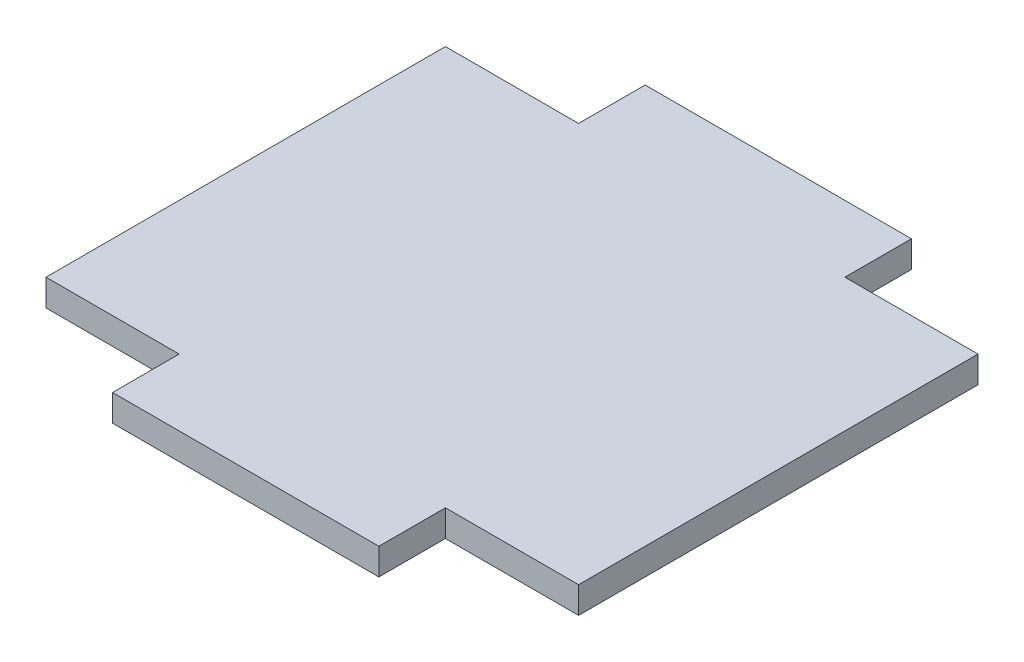
ISO-10303-21;
HEADER;
FILE_DESCRIPTION(('STEP AP214'),'2;1');
FILE_NAME('part.step','',(''),(''),'','','');
FILE_SCHEMA(('AUTOMOTIVE_DESIGN { 1 0 10303 214 1 1 1 1 }'));
ENDSEC;
DATA;
#1=APPLICATION_CONTEXT('core data for automotive mechanical design processes');
#2=APPLICATION_PROTOCOL_DEFINITION('international standard','automotive_design',2000,#1);
#3=PRODUCT_CONTEXT('',#1,'mechanical');
#4=PRODUCT('Part','Part','',(#3));
#5=PRODUCT_RELATED_PRODUCT_CATEGORY('part','',(#4));
#6=PRODUCT_DEFINITION_FORMATION('','',#4);
#7=PRODUCT_DEFINITION_CONTEXT('part definition',#1,'design');
#8=PRODUCT_DEFINITION('design','',#6,#7);
#9=PRODUCT_DEFINITION_SHAPE('','',#8);
#10=(LENGTH_UNIT() NAMED_UNIT(*) SI_UNIT(.MILLI.,.METRE.));
#11=(NAMED_UNIT(*) PLANE_ANGLE_UNIT() SI_UNIT($,.RADIAN.));
#12=(NAMED_UNIT(*) SI_UNIT($,.STERADIAN.) SOLID_ANGLE_UNIT());
#13=UNCERTAINTY_MEASURE_WITH_UNIT(LENGTH_MEASURE(1.E-05),#10,'distance_accuracy_value','');
#14=(GEOMETRIC_REPRESENTATION_CONTEXT(3) GLOBAL_UNCERTAINTY_ASSIGNED_CONTEXT((#13)) GLOBAL_UNIT_ASSIGNED_CONTEXT((#10,
#11,#12)) REPRESENTATION_CONTEXT('',''));
#15=CARTESIAN_POINT('',(0.,0.,0.));
#16=DIRECTION('',(0.,0.,1.));
#17=DIRECTION('',(1.,0.,0.));
#18=AXIS2_PLACEMENT_3D('',#15,#16,#17);
#19=CARTESIAN_POINT('',(-0.5,0.0499999999999997,-1.));
#20=DIRECTION('',(-1.,0.,0.));
#21=DIRECTION('',(0.,0.,1.));
#22=AXIS2_PLACEMENT_3D('',#19,#20,#21);
#23=PLANE('',#22);
#24=DIRECTION('',(0.,1.,0.));
#25=VECTOR('',#24,1.);
#26=CARTESIAN_POINT('',(-0.5,0.0499999999999997,0.750000000000001));
#27=LINE('',#26,#25);
#28=CARTESIAN_POINT('',(-0.5,-0.0500000000000006,0.750000000000001));
#29=VERTEX_POINT('',#28);
#30=CARTESIAN_POINT('',(-0.5,0.0499999999999997,0.750000000000001));
#31=VERTEX_POINT('',#30);
#32=EDGE_CURVE('E183',#29,#31,#27,.T.);
#33=ORIENTED_EDGE('',*,*,#32,.F.);
#34=DIRECTION('',(0.,0.,1.));
#35=VECTOR('',#34,1.);
#36=CARTESIAN_POINT('',(-0.5,-0.0500000000000006,-1.));
#37=LINE('',#36,#35);
#38=CARTESIAN_POINT('',(-0.5,-0.0500000000000006,1.));
#39=VERTEX_POINT('',#38);
#40=EDGE_CURVE('E208',#29,#39,#37,.T.);
#41=ORIENTED_EDGE('',*,*,#40,.T.);
#42=DIRECTION('',(0.,-1.,0.));
#43=VECTOR('',#42,1.);
#44=CARTESIAN_POINT('',(-0.5,0.0499999999999997,1.));
#45=LINE('',#44,#43);
#46=CARTESIAN_POINT('',(-0.5,0.0499999999999997,1.));
#47=VERTEX_POINT('',#46);
#48=EDGE_CURVE('E185',#47,#39,#45,.T.);
#49=ORIENTED_EDGE('',*,*,#48,.F.);
#50=DIRECTION('',(0.,0.,1.));
#51=VECTOR('',#50,1.);
#52=CARTESIAN_POINT('',(-0.5,0.0499999999999997,-1.));
#53=LINE('',#52,#51);
#54=EDGE_CURVE('E45',#31,#47,#53,.T.);
#55=ORIENTED_EDGE('',*,*,#54,.F.);
#56=EDGE_LOOP('',(#33,#41,#49,#55));
#57=FACE_BOUND('',#56,.T.);
#58=ADVANCED_FACE('F36',(#57),#23,.T.);
#59=CARTESIAN_POINT('',(0.5,-0.0500000000000006,-1.));
#60=DIRECTION('',(1.,0.,0.));
#61=DIRECTION('',(0.,0.,-1.));
#62=AXIS2_PLACEMENT_3D('',#59,#60,#61);
#63=PLANE('',#62);
#64=DIRECTION('',(0.,-1.,0.));
#65=VECTOR('',#64,1.);
#66=CARTESIAN_POINT('',(0.5,-0.0500000000000006,0.750000000000001));
#67=LINE('',#66,#65);
#68=CARTESIAN_POINT('',(0.5,0.0499999999999997,0.750000000000001));
#69=VERTEX_POINT('',#68);
#70=CARTESIAN_POINT('',(0.5,-0.0500000000000006,0.750000000000001));
#71=VERTEX_POINT('',#70);
#72=EDGE_CURVE('E132',#69,#71,#67,.T.);
#73=ORIENTED_EDGE('',*,*,#72,.F.);
#74=DIRECTION('',(0.,0.,1.));
#75=VECTOR('',#74,1.);
#76=CARTESIAN_POINT('',(0.5,0.0499999999999997,-1.));
#77=LINE('',#76,#75);
#78=CARTESIAN_POINT('',(0.5,0.0499999999999997,1.));
#79=VERTEX_POINT('',#78);
#80=EDGE_CURVE('E212',#69,#79,#77,.T.);
#81=ORIENTED_EDGE('',*,*,#80,.T.);
#82=DIRECTION('',(0.,1.,0.));
#83=VECTOR('',#82,1.);
#84=CARTESIAN_POINT('',(0.5,-0.0500000000000006,1.));
#85=LINE('',#84,#83);
#86=CARTESIAN_POINT('',(0.5,-0.0500000000000006,1.));
#87=VERTEX_POINT('',#86);
#88=EDGE_CURVE('E191',#87,#79,#85,.T.);
#89=ORIENTED_EDGE('',*,*,#88,.F.);
#90=DIRECTION('',(0.,0.,1.));
#91=VECTOR('',#90,1.);
#92=CARTESIAN_POINT('',(0.5,-0.0500000000000006,-1.));
#93=LINE('',#92,#91);
#94=EDGE_CURVE('E214',#71,#87,#93,.T.);
#95=ORIENTED_EDGE('',*,*,#94,.F.);
#96=EDGE_LOOP('',(#73,#81,#89,#95));
#97=FACE_BOUND('',#96,.T.);
#98=ADVANCED_FACE('F246',(#97),#63,.T.);
#99=DIRECTION('',(0.,-1.,0.));
#100=VECTOR('',#99,1.);
#101=CARTESIAN_POINT('',(-0.5,0.0499999999999997,-0.750000000000001));
#102=LINE('',#101,#100);
#103=CARTESIAN_POINT('',(-0.5,0.0499999999999997,-0.750000000000001));
#104=VERTEX_POINT('',#103);
#105=CARTESIAN_POINT('',(-0.5,-0.0500000000000006,-0.750000000000001));
#106=VERTEX_POINT('',#105);
#107=EDGE_CURVE('E60',#104,#106,#102,.T.);
#108=ORIENTED_EDGE('',*,*,#107,.F.);
#109=CARTESIAN_POINT('',(-0.5,0.0499999999999997,-1.));
#110=VERTEX_POINT('',#109);
#111=EDGE_CURVE('E11',#110,#104,#53,.T.);
#112=ORIENTED_EDGE('',*,*,#111,.F.);
#113=DIRECTION('',(0.,-1.,0.));
#114=VECTOR('',#113,1.);
#115=CARTESIAN_POINT('',(-0.5,0.0499999999999997,-1.));
#116=LINE('',#115,#114);
#117=CARTESIAN_POINT('',(-0.5,-0.0500000000000006,-1.));
#118=VERTEX_POINT('',#117);
#119=EDGE_CURVE('E197',#110,#118,#116,.T.);
#120=ORIENTED_EDGE('',*,*,#119,.T.);
#121=EDGE_CURVE('E40',#118,#106,#37,.T.);
#122=ORIENTED_EDGE('',*,*,#121,.T.);
#123=EDGE_LOOP('',(#108,#112,#120,#122));
#124=FACE_BOUND('',#123,.T.);
#125=ADVANCED_FACE('F38',(#124),#23,.T.);
#126=CARTESIAN_POINT('',(-0.5,0.0499999999999997,-1.));
#127=DIRECTION('',(0.,1.,0.));
#128=DIRECTION('',(0.,0.,1.));
#129=AXIS2_PLACEMENT_3D('',#126,#127,#128);
#130=PLANE('',#129);
#131=ORIENTED_EDGE('',*,*,#111,.T.);
#132=DIRECTION('',(1.,0.,0.));
#133=VECTOR('',#132,1.);
#134=CARTESIAN_POINT('',(-1.,0.0499999999999997,-0.750000000000001));
#135=LINE('',#134,#133);
#136=CARTESIAN_POINT('',(-1.,0.0499999999999997,-0.750000000000001));
#137=VERTEX_POINT('',#136);
#138=EDGE_CURVE('E172',#137,#104,#135,.T.);
#139=ORIENTED_EDGE('',*,*,#138,.F.);
#140=DIRECTION('',(0.,0.,1.));
#141=VECTOR('',#140,1.);
#142=CARTESIAN_POINT('',(-1.,0.0499999999999997,0.750000000000001));
#143=LINE('',#142,#141);
#144=CARTESIAN_POINT('',(-1.,0.0499999999999997,0.750000000000001));
#145=VERTEX_POINT('',#144);
#146=EDGE_CURVE('E136',#137,#145,#143,.T.);
#147=ORIENTED_EDGE('',*,*,#146,.T.);
#148=DIRECTION('',(1.,0.,0.));
#149=VECTOR('',#148,1.);
#150=CARTESIAN_POINT('',(-1.,0.0499999999999997,0.750000000000001));
#151=LINE('',#150,#149);
#152=EDGE_CURVE('E167',#145,#31,#151,.T.);
#153=ORIENTED_EDGE('',*,*,#152,.T.);
#154=ORIENTED_EDGE('',*,*,#54,.T.);
#155=DIRECTION('',(-1.,0.,0.));
#156=VECTOR('',#155,1.);
#157=CARTESIAN_POINT('',(-0.5,0.0499999999999997,1.));
#158=LINE('',#157,#156);
#159=EDGE_CURVE('E194',#79,#47,#158,.T.);
#160=ORIENTED_EDGE('',*,*,#159,.F.);
#161=ORIENTED_EDGE('',*,*,#80,.F.);
#162=CARTESIAN_POINT('',(1.,0.0499999999999997,0.750000000000001));
#163=VERTEX_POINT('',#162);
#164=EDGE_CURVE('E171',#69,#163,#151,.T.);
#165=ORIENTED_EDGE('',*,*,#164,.T.);
#166=DIRECTION('',(0.,0.,1.));
#167=VECTOR('',#166,1.);
#168=CARTESIAN_POINT('',(1.,0.0499999999999997,0.750000000000001));
#169=LINE('',#168,#167);
#170=CARTESIAN_POINT('',(1.,0.0499999999999997,-0.750000000000001));
#171=VERTEX_POINT('',#170);
#172=EDGE_CURVE('E151',#171,#163,#169,.T.);
#173=ORIENTED_EDGE('',*,*,#172,.F.);
#174=CARTESIAN_POINT('',(0.5,0.0499999999999997,-0.750000000000001));
#175=VERTEX_POINT('',#174);
#176=EDGE_CURVE('E175',#175,#171,#135,.T.);
#177=ORIENTED_EDGE('',*,*,#176,.F.);
#178=CARTESIAN_POINT('',(0.5,0.0499999999999997,-1.));
#179=VERTEX_POINT('',#178);
#180=EDGE_CURVE('E210',#179,#175,#77,.T.);
#181=ORIENTED_EDGE('',*,*,#180,.F.);
#182=DIRECTION('',(-1.,0.,0.));
#183=VECTOR('',#182,1.);
#184=CARTESIAN_POINT('',(-0.5,0.0499999999999997,-1.));
#185=LINE('',#184,#183);
#186=EDGE_CURVE('E206',#179,#110,#185,.T.);
#187=ORIENTED_EDGE('',*,*,#186,.T.);
#188=EDGE_LOOP('',(#131,#139,#147,#153,#154,#160,#161,#165,#173,#177,#181,#187));
#189=FACE_BOUND('',#188,.T.);
#190=ADVANCED_FACE('F222',(#189),#130,.T.);
#191=DIRECTION('',(0.,1.,0.));
#192=VECTOR('',#191,1.);
#193=CARTESIAN_POINT('',(0.5,-0.0500000000000006,-0.750000000000001));
#194=LINE('',#193,#192);
#195=CARTESIAN_POINT('',(0.5,-0.0500000000000006,-0.750000000000001));
#196=VERTEX_POINT('',#195);
#197=EDGE_CURVE('E170',#196,#175,#194,.T.);
#198=ORIENTED_EDGE('',*,*,#197,.F.);
#199=CARTESIAN_POINT('',(0.5,-0.0500000000000006,-1.));
#200=VERTEX_POINT('',#199);
#201=EDGE_CURVE('E213',#200,#196,#93,.T.);
#202=ORIENTED_EDGE('',*,*,#201,.F.);
#203=DIRECTION('',(0.,1.,0.));
#204=VECTOR('',#203,1.);
#205=CARTESIAN_POINT('',(0.5,-0.0500000000000006,-1.));
#206=LINE('',#205,#204);
#207=EDGE_CURVE('E203',#200,#179,#206,.T.);
#208=ORIENTED_EDGE('',*,*,#207,.T.);
#209=ORIENTED_EDGE('',*,*,#180,.T.);
#210=EDGE_LOOP('',(#198,#202,#208,#209));
#211=FACE_BOUND('',#210,.T.);
#212=ADVANCED_FACE('F241',(#211),#63,.T.);
#213=CARTESIAN_POINT('',(-0.5,-0.0500000000000006,-1.));
#214=DIRECTION('',(0.,-1.,0.));
#215=DIRECTION('',(0.,0.,-1.));
#216=AXIS2_PLACEMENT_3D('',#213,#214,#215);
#217=PLANE('',#216);
#218=ORIENTED_EDGE('',*,*,#201,.T.);
#219=DIRECTION('',(1.,0.,0.));
#220=VECTOR('',#219,1.);
#221=CARTESIAN_POINT('',(-1.,-0.0500000000000006,-0.750000000000001));
#222=LINE('',#221,#220);
#223=CARTESIAN_POINT('',(1.,-0.0500000000000006,-0.750000000000001));
#224=VERTEX_POINT('',#223);
#225=EDGE_CURVE('E142',#196,#224,#222,.T.);
#226=ORIENTED_EDGE('',*,*,#225,.T.);
#227=DIRECTION('',(0.,0.,-1.));
#228=VECTOR('',#227,1.);
#229=CARTESIAN_POINT('',(1.,-0.0500000000000006,0.750000000000001));
#230=LINE('',#229,#228);
#231=CARTESIAN_POINT('',(1.,-0.0500000000000006,0.750000000000001));
#232=VERTEX_POINT('',#231);
#233=EDGE_CURVE('E139',#232,#224,#230,.T.);
#234=ORIENTED_EDGE('',*,*,#233,.F.);
#235=DIRECTION('',(1.,0.,0.));
#236=VECTOR('',#235,1.);
#237=CARTESIAN_POINT('',(-1.,-0.0500000000000006,0.750000000000001));
#238=LINE('',#237,#236);
#239=EDGE_CURVE('E126',#71,#232,#238,.T.);
#240=ORIENTED_EDGE('',*,*,#239,.F.);
#241=ORIENTED_EDGE('',*,*,#94,.T.);
#242=DIRECTION('',(1.,0.,0.));
#243=VECTOR('',#242,1.);
#244=CARTESIAN_POINT('',(-0.5,-0.0500000000000006,1.));
#245=LINE('',#244,#243);
#246=EDGE_CURVE('E188',#39,#87,#245,.T.);
#247=ORIENTED_EDGE('',*,*,#246,.F.);
#248=ORIENTED_EDGE('',*,*,#40,.F.);
#249=CARTESIAN_POINT('',(-1.,-0.0500000000000006,0.750000000000001));
#250=VERTEX_POINT('',#249);
#251=EDGE_CURVE('E135',#250,#29,#238,.T.);
#252=ORIENTED_EDGE('',*,*,#251,.F.);
#253=DIRECTION('',(0.,0.,-1.));
#254=VECTOR('',#253,1.);
#255=CARTESIAN_POINT('',(-1.,-0.0500000000000006,0.750000000000001));
#256=LINE('',#255,#254);
#257=CARTESIAN_POINT('',(-1.,-0.0500000000000006,-0.750000000000001));
#258=VERTEX_POINT('',#257);
#259=EDGE_CURVE('E159',#250,#258,#256,.T.);
#260=ORIENTED_EDGE('',*,*,#259,.T.);
#261=EDGE_CURVE('E176',#258,#106,#222,.T.);
#262=ORIENTED_EDGE('',*,*,#261,.T.);
#263=ORIENTED_EDGE('',*,*,#121,.F.);
#264=DIRECTION('',(1.,0.,0.));
#265=VECTOR('',#264,1.);
#266=CARTESIAN_POINT('',(-0.5,-0.0500000000000006,-1.));
#267=LINE('',#266,#265);
#268=EDGE_CURVE('E200',#118,#200,#267,.T.);
#269=ORIENTED_EDGE('',*,*,#268,.T.);
#270=EDGE_LOOP('',(#218,#226,#234,#240,#241,#247,#248,#252,#260,#262,#263,#269));
#271=FACE_BOUND('',#270,.T.);
#272=ADVANCED_FACE('F141',(#271),#217,.T.);
#273=CARTESIAN_POINT('',(-0.5,-0.0500000000000006,-1.));
#274=DIRECTION('',(0.,0.,1.));
#275=DIRECTION('',(1.,0.,0.));
#276=AXIS2_PLACEMENT_3D('',#273,#274,#275);
#277=PLANE('',#276);
#278=ORIENTED_EDGE('',*,*,#119,.F.);
#279=ORIENTED_EDGE('',*,*,#186,.F.);
#280=ORIENTED_EDGE('',*,*,#207,.F.);
#281=ORIENTED_EDGE('',*,*,#268,.F.);
#282=EDGE_LOOP('',(#278,#279,#280,#281));
#283=FACE_BOUND('',#282,.T.);
#284=ADVANCED_FACE('F237',(#283),#277,.F.);
#285=CARTESIAN_POINT('',(-0.5,-0.0500000000000006,1.));
#286=DIRECTION('',(0.,0.,1.));
#287=DIRECTION('',(1.,0.,0.));
#288=AXIS2_PLACEMENT_3D('',#285,#286,#287);
#289=PLANE('',#288);
#290=ORIENTED_EDGE('',*,*,#48,.T.);
#291=ORIENTED_EDGE('',*,*,#246,.T.);
#292=ORIENTED_EDGE('',*,*,#88,.T.);
#293=ORIENTED_EDGE('',*,*,#159,.T.);
#294=EDGE_LOOP('',(#290,#291,#292,#293));
#295=FACE_BOUND('',#294,.T.);
#296=ADVANCED_FACE('F218',(#295),#289,.T.);
#297=CARTESIAN_POINT('',(1.,-0.0500000000000006,0.750000000000001));
#298=DIRECTION('',(1.,0.,0.));
#299=DIRECTION('',(0.,0.,-1.));
#300=AXIS2_PLACEMENT_3D('',#297,#298,#299);
#301=PLANE('',#300);
#302=DIRECTION('',(0.,-1.,0.));
#303=VECTOR('',#302,1.);
#304=CARTESIAN_POINT('',(1.,0.0499999999999997,0.750000000000001));
#305=LINE('',#304,#303);
#306=EDGE_CURVE('E130',#163,#232,#305,.T.);
#307=ORIENTED_EDGE('',*,*,#306,.T.);
#308=ORIENTED_EDGE('',*,*,#233,.T.);
#309=DIRECTION('',(0.,1.,0.));
#310=VECTOR('',#309,1.);
#311=CARTESIAN_POINT('',(1.,0.0499999999999997,-0.750000000000001));
#312=LINE('',#311,#310);
#313=EDGE_CURVE('E146',#224,#171,#312,.T.);
#314=ORIENTED_EDGE('',*,*,#313,.T.);
#315=ORIENTED_EDGE('',*,*,#172,.T.);
#316=EDGE_LOOP('',(#307,#308,#314,#315));
#317=FACE_BOUND('',#316,.T.);
#318=ADVANCED_FACE('F149',(#317),#301,.T.);
#319=CARTESIAN_POINT('',(-1.,0.0499999999999997,-0.750000000000001));
#320=DIRECTION('',(0.,0.,-1.));
#321=DIRECTION('',(-1.,0.,0.));
#322=AXIS2_PLACEMENT_3D('',#319,#320,#321);
#323=PLANE('',#322);
#324=ORIENTED_EDGE('',*,*,#225,.F.);
#325=ORIENTED_EDGE('',*,*,#197,.T.);
#326=ORIENTED_EDGE('',*,*,#176,.T.);
#327=ORIENTED_EDGE('',*,*,#313,.F.);
#328=EDGE_LOOP('',(#324,#325,#326,#327));
#329=FACE_BOUND('',#328,.T.);
#330=ADVANCED_FACE('F244',(#329),#323,.T.);
#331=CARTESIAN_POINT('',(-1.,0.0499999999999997,0.750000000000001));
#332=DIRECTION('',(0.,0.,1.));
#333=DIRECTION('',(1.,0.,0.));
#334=AXIS2_PLACEMENT_3D('',#331,#332,#333);
#335=PLANE('',#334);
#336=ORIENTED_EDGE('',*,*,#164,.F.);
#337=ORIENTED_EDGE('',*,*,#72,.T.);
#338=ORIENTED_EDGE('',*,*,#239,.T.);
#339=ORIENTED_EDGE('',*,*,#306,.F.);
#340=EDGE_LOOP('',(#336,#337,#338,#339));
#341=FACE_BOUND('',#340,.T.);
#342=ADVANCED_FACE('F128',(#341),#335,.T.);
#343=ORIENTED_EDGE('',*,*,#251,.T.);
#344=ORIENTED_EDGE('',*,*,#32,.T.);
#345=ORIENTED_EDGE('',*,*,#152,.F.);
#346=DIRECTION('',(0.,-1.,0.));
#347=VECTOR('',#346,1.);
#348=CARTESIAN_POINT('',(-1.,0.0499999999999997,0.750000000000001));
#349=LINE('',#348,#347);
#350=EDGE_CURVE('E156',#145,#250,#349,.T.);
#351=ORIENTED_EDGE('',*,*,#350,.T.);
#352=EDGE_LOOP('',(#343,#344,#345,#351));
#353=FACE_BOUND('',#352,.T.);
#354=ADVANCED_FACE('F226',(#353),#335,.T.);
#355=ORIENTED_EDGE('',*,*,#138,.T.);
#356=ORIENTED_EDGE('',*,*,#107,.T.);
#357=ORIENTED_EDGE('',*,*,#261,.F.);
#358=DIRECTION('',(0.,1.,0.));
#359=VECTOR('',#358,1.);
#360=CARTESIAN_POINT('',(-1.,0.0499999999999997,-0.750000000000001));
#361=LINE('',#360,#359);
#362=EDGE_CURVE('E162',#258,#137,#361,.T.);
#363=ORIENTED_EDGE('',*,*,#362,.T.);
#364=EDGE_LOOP('',(#355,#356,#357,#363));
#365=FACE_BOUND('',#364,.T.);
#366=ADVANCED_FACE('F233',(#365),#323,.T.);
#367=CARTESIAN_POINT('',(-1.,-0.0500000000000006,0.750000000000001));
#368=DIRECTION('',(1.,0.,0.));
#369=DIRECTION('',(0.,0.,-1.));
#370=AXIS2_PLACEMENT_3D('',#367,#368,#369);
#371=PLANE('',#370);
#372=ORIENTED_EDGE('',*,*,#350,.F.);
#373=ORIENTED_EDGE('',*,*,#146,.F.);
#374=ORIENTED_EDGE('',*,*,#362,.F.);
#375=ORIENTED_EDGE('',*,*,#259,.F.);
#376=EDGE_LOOP('',(#372,#373,#374,#375));
#377=FACE_BOUND('',#376,.T.);
#378=ADVANCED_FACE('F229',(#377),#371,.F.);
#379=CLOSED_SHELL('',(#58,#98,#125,#190,#212,#272,#284,#296,#318,#330,#342,#354,#366,#378));
#380=MANIFOLD_SOLID_BREP('B2',#379);
#381=ADVANCED_BREP_SHAPE_REPRESENTATION('',(#18,#380),#14);
#382=SHAPE_DEFINITION_REPRESENTATION(#9,#381);
ENDSEC;
END-ISO-10303-21;
